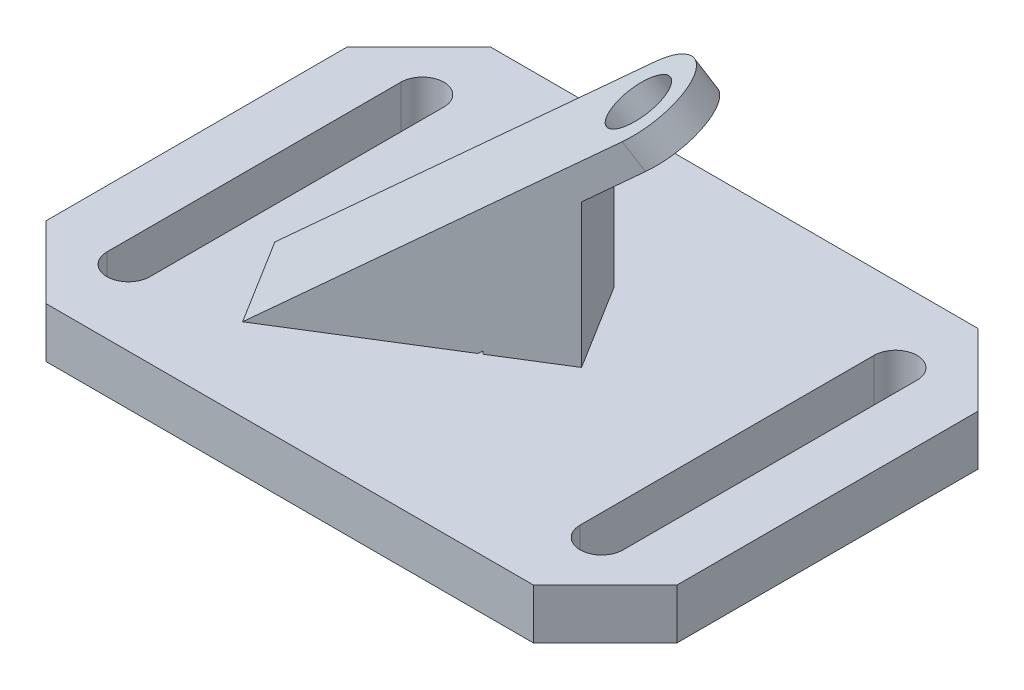
ISO-10303-21;
HEADER;
FILE_DESCRIPTION(('STEP AP214'),'2;1');
FILE_NAME('part.step','',(''),(''),'','','');
FILE_SCHEMA(('AUTOMOTIVE_DESIGN { 1 0 10303 214 1 1 1 1 }'));
ENDSEC;
DATA;
#1=APPLICATION_CONTEXT('core data for automotive mechanical design processes');
#2=APPLICATION_PROTOCOL_DEFINITION('international standard','automotive_design',2000,#1);
#3=PRODUCT_CONTEXT('',#1,'mechanical');
#4=PRODUCT('Part','Part','',(#3));
#5=PRODUCT_RELATED_PRODUCT_CATEGORY('part','',(#4));
#6=PRODUCT_DEFINITION_FORMATION('','',#4);
#7=PRODUCT_DEFINITION_CONTEXT('part definition',#1,'design');
#8=PRODUCT_DEFINITION('design','',#6,#7);
#9=PRODUCT_DEFINITION_SHAPE('','',#8);
#10=(LENGTH_UNIT() NAMED_UNIT(*) SI_UNIT(.MILLI.,.METRE.));
#11=(NAMED_UNIT(*) PLANE_ANGLE_UNIT() SI_UNIT($,.RADIAN.));
#12=(NAMED_UNIT(*) SI_UNIT($,.STERADIAN.) SOLID_ANGLE_UNIT());
#13=UNCERTAINTY_MEASURE_WITH_UNIT(LENGTH_MEASURE(1.E-05),#10,'distance_accuracy_value','');
#14=(GEOMETRIC_REPRESENTATION_CONTEXT(3) GLOBAL_UNCERTAINTY_ASSIGNED_CONTEXT((#13)) GLOBAL_UNIT_ASSIGNED_CONTEXT((#10,
#11,#12)) REPRESENTATION_CONTEXT('',''));
#15=CARTESIAN_POINT('',(0.,0.,0.));
#16=DIRECTION('',(0.,0.,1.));
#17=DIRECTION('',(1.,0.,0.));
#18=AXIS2_PLACEMENT_3D('',#15,#16,#17);
#19=CARTESIAN_POINT('',(0.,7.,0.));
#20=DIRECTION('',(0.,1.,0.));
#21=DIRECTION('',(0.,0.,1.));
#22=AXIS2_PLACEMENT_3D('',#19,#20,#21);
#23=PLANE('',#22);
#24=DIRECTION('',(-1.,0.,0.));
#25=VECTOR('',#24,1.);
#26=CARTESIAN_POINT('',(-34.,7.,-31.));
#27=LINE('',#26,#25);
#28=CARTESIAN_POINT('',(34.,7.,-31.));
#29=VERTEX_POINT('',#28);
#30=CARTESIAN_POINT('',(-34.,7.,-31.));
#31=VERTEX_POINT('',#30);
#32=EDGE_CURVE('E350',#29,#31,#27,.T.);
#33=ORIENTED_EDGE('',*,*,#32,.T.);
#34=DIRECTION('',(-0.707106781186548,0.,0.707106781186547));
#35=VECTOR('',#34,1.);
#36=CARTESIAN_POINT('',(-44.,7.,-21.));
#37=LINE('',#36,#35);
#38=CARTESIAN_POINT('',(-44.,7.,-21.));
#39=VERTEX_POINT('',#38);
#40=EDGE_CURVE('E353',#31,#39,#37,.T.);
#41=ORIENTED_EDGE('',*,*,#40,.T.);
#42=DIRECTION('',(0.,0.,1.));
#43=VECTOR('',#42,1.);
#44=CARTESIAN_POINT('',(-44.,7.,21.));
#45=LINE('',#44,#43);
#46=CARTESIAN_POINT('',(-44.,7.,21.));
#47=VERTEX_POINT('',#46);
#48=EDGE_CURVE('E356',#39,#47,#45,.T.);
#49=ORIENTED_EDGE('',*,*,#48,.T.);
#50=DIRECTION('',(0.707106781186548,0.,0.707106781186547));
#51=VECTOR('',#50,1.);
#52=CARTESIAN_POINT('',(-44.,7.,21.));
#53=LINE('',#52,#51);
#54=CARTESIAN_POINT('',(-34.,7.,31.));
#55=VERTEX_POINT('',#54);
#56=EDGE_CURVE('E358',#47,#55,#53,.T.);
#57=ORIENTED_EDGE('',*,*,#56,.T.);
#58=DIRECTION('',(1.,0.,0.));
#59=VECTOR('',#58,1.);
#60=CARTESIAN_POINT('',(-34.,7.,31.));
#61=LINE('',#60,#59);
#62=CARTESIAN_POINT('',(34.,7.,31.));
#63=VERTEX_POINT('',#62);
#64=EDGE_CURVE('E360',#55,#63,#61,.T.);
#65=ORIENTED_EDGE('',*,*,#64,.T.);
#66=DIRECTION('',(0.707106781186548,0.,-0.707106781186547));
#67=VECTOR('',#66,1.);
#68=CARTESIAN_POINT('',(34.,7.,31.));
#69=LINE('',#68,#67);
#70=CARTESIAN_POINT('',(44.,7.,21.));
#71=VERTEX_POINT('',#70);
#72=EDGE_CURVE('E362',#63,#71,#69,.T.);
#73=ORIENTED_EDGE('',*,*,#72,.T.);
#74=DIRECTION('',(0.,0.,-1.));
#75=VECTOR('',#74,1.);
#76=CARTESIAN_POINT('',(44.,7.,21.));
#77=LINE('',#76,#75);
#78=CARTESIAN_POINT('',(44.,7.,-21.));
#79=VERTEX_POINT('',#78);
#80=EDGE_CURVE('E364',#71,#79,#77,.T.);
#81=ORIENTED_EDGE('',*,*,#80,.T.);
#82=DIRECTION('',(-0.707106781186548,0.,-0.707106781186547));
#83=VECTOR('',#82,1.);
#84=CARTESIAN_POINT('',(34.,7.,-31.));
#85=LINE('',#84,#83);
#86=EDGE_CURVE('E366',#79,#29,#85,.T.);
#87=ORIENTED_EDGE('',*,*,#86,.T.);
#88=EDGE_LOOP('',(#33,#41,#49,#57,#65,#73,#81,#87));
#89=FACE_BOUND('',#88,.T.);
#90=DIRECTION('',(0.,0.,1.));
#91=VECTOR('',#90,1.);
#92=CARTESIAN_POINT('',(-36.,7.,-20.5));
#93=LINE('',#92,#91);
#94=CARTESIAN_POINT('',(-36.,7.,-20.5));
#95=VERTEX_POINT('',#94);
#96=CARTESIAN_POINT('',(-36.,7.,20.5));
#97=VERTEX_POINT('',#96);
#98=EDGE_CURVE('E321',#95,#97,#93,.T.);
#99=ORIENTED_EDGE('',*,*,#98,.F.);
#100=CARTESIAN_POINT('',(-33.,7.,-20.5));
#101=DIRECTION('',(0.,1.,0.));
#102=DIRECTION('',(0.,0.,1.));
#103=AXIS2_PLACEMENT_3D('',#100,#101,#102);
#104=CIRCLE('',#103,3.);
#105=CARTESIAN_POINT('',(-30.,7.,-20.5));
#106=VERTEX_POINT('',#105);
#107=EDGE_CURVE('E319',#106,#95,#104,.T.);
#108=ORIENTED_EDGE('',*,*,#107,.F.);
#109=DIRECTION('',(0.,0.,-1.));
#110=VECTOR('',#109,1.);
#111=CARTESIAN_POINT('',(-30.,7.,-20.5));
#112=LINE('',#111,#110);
#113=CARTESIAN_POINT('',(-30.,7.,20.5));
#114=VERTEX_POINT('',#113);
#115=EDGE_CURVE('E327',#114,#106,#112,.T.);
#116=ORIENTED_EDGE('',*,*,#115,.F.);
#117=CARTESIAN_POINT('',(-33.,7.,20.5));
#118=DIRECTION('',(0.,1.,0.));
#119=DIRECTION('',(0.,0.,1.));
#120=AXIS2_PLACEMENT_3D('',#117,#118,#119);
#121=CIRCLE('',#120,3.00000000000001);
#122=EDGE_CURVE('E324',#97,#114,#121,.T.);
#123=ORIENTED_EDGE('',*,*,#122,.F.);
#124=EDGE_LOOP('',(#99,#108,#116,#123));
#125=FACE_BOUND('',#124,.T.);
#126=DIRECTION('',(0.,0.,1.));
#127=VECTOR('',#126,1.);
#128=CARTESIAN_POINT('',(30.,7.,-20.5));
#129=LINE('',#128,#127);
#130=CARTESIAN_POINT('',(30.,7.,-20.5));
#131=VERTEX_POINT('',#130);
#132=CARTESIAN_POINT('',(30.,7.,20.5));
#133=VERTEX_POINT('',#132);
#134=EDGE_CURVE('E290',#131,#133,#129,.T.);
#135=ORIENTED_EDGE('',*,*,#134,.F.);
#136=CARTESIAN_POINT('',(33.,7.,-20.5));
#137=DIRECTION('',(0.,1.,0.));
#138=DIRECTION('',(0.,0.,1.));
#139=AXIS2_PLACEMENT_3D('',#136,#137,#138);
#140=CIRCLE('',#139,3.);
#141=CARTESIAN_POINT('',(36.,7.,-20.5));
#142=VERTEX_POINT('',#141);
#143=EDGE_CURVE('E288',#142,#131,#140,.T.);
#144=ORIENTED_EDGE('',*,*,#143,.F.);
#145=DIRECTION('',(0.,0.,-1.));
#146=VECTOR('',#145,1.);
#147=CARTESIAN_POINT('',(36.,7.,-20.5));
#148=LINE('',#147,#146);
#149=CARTESIAN_POINT('',(36.,7.,20.5));
#150=VERTEX_POINT('',#149);
#151=EDGE_CURVE('E296',#150,#142,#148,.T.);
#152=ORIENTED_EDGE('',*,*,#151,.F.);
#153=CARTESIAN_POINT('',(33.,7.,20.5));
#154=DIRECTION('',(0.,1.,0.));
#155=DIRECTION('',(0.,0.,1.));
#156=AXIS2_PLACEMENT_3D('',#153,#154,#155);
#157=CIRCLE('',#156,3.);
#158=EDGE_CURVE('E293',#133,#150,#157,.T.);
#159=ORIENTED_EDGE('',*,*,#158,.F.);
#160=EDGE_LOOP('',(#135,#144,#152,#159));
#161=FACE_BOUND('',#160,.T.);
#162=DIRECTION('',(-0.527683201400473,0.,-0.849441251034907));
#163=VECTOR('',#162,1.);
#164=CARTESIAN_POINT('',(11.0657190390386,7.,1.36655236635577));
#165=LINE('',#164,#163);
#166=CARTESIAN_POINT('',(11.0657190390386,7.,1.36655236635577));
#167=VERTEX_POINT('',#166);
#168=CARTESIAN_POINT('',(3.67815421943196,7.,-10.5256251481329));
#169=VERTEX_POINT('',#168);
#170=EDGE_CURVE('E56',#167,#169,#165,.T.);
#171=ORIENTED_EDGE('',*,*,#170,.F.);
#172=DIRECTION('',(-0.849441251034907,0.,0.527683201400473));
#173=VECTOR('',#172,1.);
#174=CARTESIAN_POINT('',(11.0657190390386,7.,1.36655236635577));
#175=LINE('',#174,#173);
#176=CARTESIAN_POINT('',(2.57130652868951,7.,6.6433843803605));
#177=VERTEX_POINT('',#176);
#178=EDGE_CURVE('E51',#167,#177,#175,.T.);
#179=ORIENTED_EDGE('',*,*,#178,.T.);
#180=DIRECTION('',(-0.527683201400473,0.,-0.849441251034907));
#181=VECTOR('',#180,1.);
#182=CARTESIAN_POINT('',(2.57130652868951,7.,6.6433843803605));
#183=LINE('',#182,#181);
#184=CARTESIAN_POINT('',(-4.81625829091711,7.,-5.2487931341282));
#185=VERTEX_POINT('',#184);
#186=EDGE_CURVE('E280',#177,#185,#183,.T.);
#187=ORIENTED_EDGE('',*,*,#186,.T.);
#188=DIRECTION('',(-0.849441251034907,0.,0.527683201400473));
#189=VECTOR('',#188,1.);
#190=CARTESIAN_POINT('',(3.67815421943197,7.,-10.5256251481329));
#191=LINE('',#190,#189);
#192=EDGE_CURVE('E242',#169,#185,#191,.T.);
#193=ORIENTED_EDGE('',*,*,#192,.F.);
#194=EDGE_LOOP('',(#171,#179,#187,#193));
#195=FACE_BOUND('',#194,.T.);
#196=DIRECTION('',(0.527683201400473,0.,0.849441251034907));
#197=VECTOR('',#196,1.);
#198=CARTESIAN_POINT('',(-21.7917980740251,7.,13.5373291065914));
#199=LINE('',#198,#197);
#200=CARTESIAN_POINT('',(-25.4855804838284,7.,7.59124034934704));
#201=VERTEX_POINT('',#200);
#202=CARTESIAN_POINT('',(-18.0980156642218,7.,19.4834178638357));
#203=VERTEX_POINT('',#202);
#204=EDGE_CURVE('E11',#201,#203,#199,.T.);
#205=ORIENTED_EDGE('',*,*,#204,.F.);
#206=DIRECTION('',(-0.849441251034907,0.,0.527683201400473));
#207=VECTOR('',#206,1.);
#208=CARTESIAN_POINT('',(-3.69378240980331,7.,-5.94608875724435));
#209=LINE('',#208,#207);
#210=CARTESIAN_POINT('',(-5.25339965229698,7.,-4.97723562175586));
#211=VERTEX_POINT('',#210);
#212=EDGE_CURVE('E220',#211,#201,#209,.T.);
#213=ORIENTED_EDGE('',*,*,#212,.F.);
#214=DIRECTION('',(0.527683201400473,0.,0.849441251034907));
#215=VECTOR('',#214,1.);
#216=CARTESIAN_POINT('',(-1.55961724249367,7.,0.96885313548849));
#217=LINE('',#216,#215);
#218=CARTESIAN_POINT('',(2.13416516730965,7.,6.91494189273284));
#219=VERTEX_POINT('',#218);
#220=EDGE_CURVE('E285',#211,#219,#217,.T.);
#221=ORIENTED_EDGE('',*,*,#220,.T.);
#222=DIRECTION('',(-0.849441251034907,0.,0.527683201400473));
#223=VECTOR('',#222,1.);
#224=CARTESIAN_POINT('',(3.69378240980331,7.,5.94608875724435));
#225=LINE('',#224,#223);
#226=EDGE_CURVE('E283',#219,#203,#225,.T.);
#227=ORIENTED_EDGE('',*,*,#226,.T.);
#228=EDGE_LOOP('',(#205,#213,#221,#227));
#229=FACE_BOUND('',#228,.T.);
#230=ADVANCED_FACE('F36',(#89,#125,#161,#195,#229),#23,.T.);
#231=CARTESIAN_POINT('',(0.,0.,0.));
#232=DIRECTION('',(0.,1.,0.));
#233=DIRECTION('',(0.,0.,1.));
#234=AXIS2_PLACEMENT_3D('',#231,#232,#233);
#235=PLANE('',#234);
#236=CARTESIAN_POINT('',(33.,0.,-20.5));
#237=DIRECTION('',(0.,1.,0.));
#238=DIRECTION('',(0.,0.,1.));
#239=AXIS2_PLACEMENT_3D('',#236,#237,#238);
#240=CIRCLE('',#239,3.);
#241=CARTESIAN_POINT('',(36.,0.,-20.5));
#242=VERTEX_POINT('',#241);
#243=CARTESIAN_POINT('',(30.,0.,-20.5));
#244=VERTEX_POINT('',#243);
#245=EDGE_CURVE('E287',#242,#244,#240,.T.);
#246=ORIENTED_EDGE('',*,*,#245,.T.);
#247=DIRECTION('',(0.,0.,1.));
#248=VECTOR('',#247,1.);
#249=CARTESIAN_POINT('',(30.,0.,-20.5));
#250=LINE('',#249,#248);
#251=CARTESIAN_POINT('',(30.,0.,20.5));
#252=VERTEX_POINT('',#251);
#253=EDGE_CURVE('E301',#244,#252,#250,.T.);
#254=ORIENTED_EDGE('',*,*,#253,.T.);
#255=CARTESIAN_POINT('',(33.,0.,20.5));
#256=DIRECTION('',(0.,1.,0.));
#257=DIRECTION('',(0.,0.,1.));
#258=AXIS2_PLACEMENT_3D('',#255,#256,#257);
#259=CIRCLE('',#258,3.);
#260=CARTESIAN_POINT('',(36.,0.,20.5));
#261=VERTEX_POINT('',#260);
#262=EDGE_CURVE('E304',#252,#261,#259,.T.);
#263=ORIENTED_EDGE('',*,*,#262,.T.);
#264=DIRECTION('',(0.,0.,-1.));
#265=VECTOR('',#264,1.);
#266=CARTESIAN_POINT('',(36.,0.,-20.5));
#267=LINE('',#266,#265);
#268=EDGE_CURVE('E291',#261,#242,#267,.T.);
#269=ORIENTED_EDGE('',*,*,#268,.T.);
#270=EDGE_LOOP('',(#246,#254,#263,#269));
#271=FACE_BOUND('',#270,.T.);
#272=DIRECTION('',(-1.,0.,0.));
#273=VECTOR('',#272,1.);
#274=CARTESIAN_POINT('',(-34.,0.,-31.));
#275=LINE('',#274,#273);
#276=CARTESIAN_POINT('',(34.,0.,-31.));
#277=VERTEX_POINT('',#276);
#278=CARTESIAN_POINT('',(-34.,0.,-31.));
#279=VERTEX_POINT('',#278);
#280=EDGE_CURVE('E349',#277,#279,#275,.T.);
#281=ORIENTED_EDGE('',*,*,#280,.F.);
#282=DIRECTION('',(-0.707106781186548,0.,-0.707106781186547));
#283=VECTOR('',#282,1.);
#284=CARTESIAN_POINT('',(34.,0.,-31.));
#285=LINE('',#284,#283);
#286=CARTESIAN_POINT('',(44.,0.,-21.));
#287=VERTEX_POINT('',#286);
#288=EDGE_CURVE('E354',#287,#277,#285,.T.);
#289=ORIENTED_EDGE('',*,*,#288,.F.);
#290=DIRECTION('',(0.,0.,-1.));
#291=VECTOR('',#290,1.);
#292=CARTESIAN_POINT('',(44.,0.,21.));
#293=LINE('',#292,#291);
#294=CARTESIAN_POINT('',(44.,0.,21.));
#295=VERTEX_POINT('',#294);
#296=EDGE_CURVE('E381',#295,#287,#293,.T.);
#297=ORIENTED_EDGE('',*,*,#296,.F.);
#298=DIRECTION('',(0.707106781186548,0.,-0.707106781186547));
#299=VECTOR('',#298,1.);
#300=CARTESIAN_POINT('',(34.,0.,31.));
#301=LINE('',#300,#299);
#302=CARTESIAN_POINT('',(34.,0.,31.));
#303=VERTEX_POINT('',#302);
#304=EDGE_CURVE('E379',#303,#295,#301,.T.);
#305=ORIENTED_EDGE('',*,*,#304,.F.);
#306=DIRECTION('',(1.,0.,0.));
#307=VECTOR('',#306,1.);
#308=CARTESIAN_POINT('',(-34.,0.,31.));
#309=LINE('',#308,#307);
#310=CARTESIAN_POINT('',(-34.,0.,31.));
#311=VERTEX_POINT('',#310);
#312=EDGE_CURVE('E377',#311,#303,#309,.T.);
#313=ORIENTED_EDGE('',*,*,#312,.F.);
#314=DIRECTION('',(0.707106781186548,0.,0.707106781186547));
#315=VECTOR('',#314,1.);
#316=CARTESIAN_POINT('',(-44.,0.,21.));
#317=LINE('',#316,#315);
#318=CARTESIAN_POINT('',(-44.,0.,21.));
#319=VERTEX_POINT('',#318);
#320=EDGE_CURVE('E375',#319,#311,#317,.T.);
#321=ORIENTED_EDGE('',*,*,#320,.F.);
#322=DIRECTION('',(0.,0.,1.));
#323=VECTOR('',#322,1.);
#324=CARTESIAN_POINT('',(-44.,0.,21.));
#325=LINE('',#324,#323);
#326=CARTESIAN_POINT('',(-44.,0.,-21.));
#327=VERTEX_POINT('',#326);
#328=EDGE_CURVE('E373',#327,#319,#325,.T.);
#329=ORIENTED_EDGE('',*,*,#328,.F.);
#330=DIRECTION('',(-0.707106781186548,0.,0.707106781186547));
#331=VECTOR('',#330,1.);
#332=CARTESIAN_POINT('',(-44.,0.,-21.));
#333=LINE('',#332,#331);
#334=EDGE_CURVE('E371',#279,#327,#333,.T.);
#335=ORIENTED_EDGE('',*,*,#334,.F.);
#336=EDGE_LOOP('',(#281,#289,#297,#305,#313,#321,#329,#335));
#337=FACE_BOUND('',#336,.T.);
#338=CARTESIAN_POINT('',(-33.,0.,-20.5));
#339=DIRECTION('',(0.,1.,0.));
#340=DIRECTION('',(0.,0.,1.));
#341=AXIS2_PLACEMENT_3D('',#338,#339,#340);
#342=CIRCLE('',#341,3.);
#343=CARTESIAN_POINT('',(-30.,0.,-20.5));
#344=VERTEX_POINT('',#343);
#345=CARTESIAN_POINT('',(-36.,0.,-20.5));
#346=VERTEX_POINT('',#345);
#347=EDGE_CURVE('E318',#344,#346,#342,.T.);
#348=ORIENTED_EDGE('',*,*,#347,.T.);
#349=DIRECTION('',(0.,0.,1.));
#350=VECTOR('',#349,1.);
#351=CARTESIAN_POINT('',(-36.,0.,-20.5));
#352=LINE('',#351,#350);
#353=CARTESIAN_POINT('',(-36.,0.,20.5));
#354=VERTEX_POINT('',#353);
#355=EDGE_CURVE('E332',#346,#354,#352,.T.);
#356=ORIENTED_EDGE('',*,*,#355,.T.);
#357=CARTESIAN_POINT('',(-33.,0.,20.5));
#358=DIRECTION('',(0.,1.,0.));
#359=DIRECTION('',(0.,0.,1.));
#360=AXIS2_PLACEMENT_3D('',#357,#358,#359);
#361=CIRCLE('',#360,3.00000000000001);
#362=CARTESIAN_POINT('',(-30.,0.,20.5));
#363=VERTEX_POINT('',#362);
#364=EDGE_CURVE('E335',#354,#363,#361,.T.);
#365=ORIENTED_EDGE('',*,*,#364,.T.);
#366=DIRECTION('',(0.,0.,-1.));
#367=VECTOR('',#366,1.);
#368=CARTESIAN_POINT('',(-30.,0.,-20.5));
#369=LINE('',#368,#367);
#370=EDGE_CURVE('E322',#363,#344,#369,.T.);
#371=ORIENTED_EDGE('',*,*,#370,.T.);
#372=EDGE_LOOP('',(#348,#356,#365,#371));
#373=FACE_BOUND('',#372,.T.);
#374=DIRECTION('',(-0.849441251034907,0.,0.527683201400473));
#375=VECTOR('',#374,1.);
#376=CARTESIAN_POINT('',(3.69378240980331,0.,5.94608875724435));
#377=LINE('',#376,#375);
#378=CARTESIAN_POINT('',(-6.04992389567836,0.,11.9989972197405));
#379=VERTEX_POINT('',#378);
#380=CARTESIAN_POINT('',(-7.99730621206597,0.,13.2087347193147));
#381=VERTEX_POINT('',#380);
#382=EDGE_CURVE('E44',#379,#381,#377,.T.);
#383=ORIENTED_EDGE('',*,*,#382,.F.);
#384=DIRECTION('',(0.527683201400473,0.,0.849441251034907));
#385=VECTOR('',#384,1.);
#386=CARTESIAN_POINT('',(-9.74370630548166,0.,6.05290846249619));
#387=LINE('',#386,#385);
#388=CARTESIAN_POINT('',(-13.437488715285,0.,0.10681970525184));
#389=VERTEX_POINT('',#388);
#390=EDGE_CURVE('E410',#389,#379,#387,.T.);
#391=ORIENTED_EDGE('',*,*,#390,.F.);
#392=DIRECTION('',(-0.849441251034907,0.,0.527683201400473));
#393=VECTOR('',#392,1.);
#394=CARTESIAN_POINT('',(-3.69378240980331,0.,-5.94608875724435));
#395=LINE('',#394,#393);
#396=CARTESIAN_POINT('',(-15.3848710316726,0.,1.31655720482596));
#397=VERTEX_POINT('',#396);
#398=EDGE_CURVE('E407',#389,#397,#395,.T.);
#399=ORIENTED_EDGE('',*,*,#398,.T.);
#400=DIRECTION('',(0.527683201400473,0.,0.849441251034907));
#401=VECTOR('',#400,1.);
#402=CARTESIAN_POINT('',(-11.6910886218693,0.,7.26264596207031));
#403=LINE('',#402,#401);
#404=EDGE_CURVE('E412',#397,#381,#403,.T.);
#405=ORIENTED_EDGE('',*,*,#404,.T.);
#406=EDGE_LOOP('',(#383,#391,#399,#405));
#407=FACE_BOUND('',#406,.T.);
#408=ADVANCED_FACE('F425',(#271,#337,#373,#407),#235,.F.);
#409=CARTESIAN_POINT('',(-34.,7.,-31.));
#410=DIRECTION('',(0.,0.,1.));
#411=DIRECTION('',(1.,0.,0.));
#412=AXIS2_PLACEMENT_3D('',#409,#410,#411);
#413=PLANE('',#412);
#414=ORIENTED_EDGE('',*,*,#280,.T.);
#415=DIRECTION('',(0.,-1.,0.));
#416=VECTOR('',#415,1.);
#417=CARTESIAN_POINT('',(-34.,7.,-31.));
#418=LINE('',#417,#416);
#419=EDGE_CURVE('E404',#31,#279,#418,.T.);
#420=ORIENTED_EDGE('',*,*,#419,.F.);
#421=ORIENTED_EDGE('',*,*,#32,.F.);
#422=DIRECTION('',(0.,-1.,0.));
#423=VECTOR('',#422,1.);
#424=CARTESIAN_POINT('',(34.,7.,-31.));
#425=LINE('',#424,#423);
#426=EDGE_CURVE('E368',#29,#277,#425,.T.);
#427=ORIENTED_EDGE('',*,*,#426,.T.);
#428=EDGE_LOOP('',(#414,#420,#421,#427));
#429=FACE_BOUND('',#428,.T.);
#430=ADVANCED_FACE('F38',(#429),#413,.F.);
#431=CARTESIAN_POINT('',(-44.,7.,-21.));
#432=DIRECTION('',(0.707106781186547,0.,0.707106781186548));
#433=DIRECTION('',(0.707106781186548,0.,-0.707106781186547));
#434=AXIS2_PLACEMENT_3D('',#431,#432,#433);
#435=PLANE('',#434);
#436=ORIENTED_EDGE('',*,*,#334,.T.);
#437=DIRECTION('',(0.,-1.,0.));
#438=VECTOR('',#437,1.);
#439=CARTESIAN_POINT('',(-44.,7.,-21.));
#440=LINE('',#439,#438);
#441=EDGE_CURVE('E401',#39,#327,#440,.T.);
#442=ORIENTED_EDGE('',*,*,#441,.F.);
#443=ORIENTED_EDGE('',*,*,#40,.F.);
#444=ORIENTED_EDGE('',*,*,#419,.T.);
#445=EDGE_LOOP('',(#436,#442,#443,#444));
#446=FACE_BOUND('',#445,.T.);
#447=ADVANCED_FACE('F480',(#446),#435,.F.);
#448=CARTESIAN_POINT('',(-44.,7.,21.));
#449=DIRECTION('',(1.,0.,0.));
#450=DIRECTION('',(0.,0.,-1.));
#451=AXIS2_PLACEMENT_3D('',#448,#449,#450);
#452=PLANE('',#451);
#453=ORIENTED_EDGE('',*,*,#328,.T.);
#454=DIRECTION('',(0.,-1.,0.));
#455=VECTOR('',#454,1.);
#456=CARTESIAN_POINT('',(-44.,7.,21.));
#457=LINE('',#456,#455);
#458=EDGE_CURVE('E398',#47,#319,#457,.T.);
#459=ORIENTED_EDGE('',*,*,#458,.F.);
#460=ORIENTED_EDGE('',*,*,#48,.F.);
#461=ORIENTED_EDGE('',*,*,#441,.T.);
#462=EDGE_LOOP('',(#453,#459,#460,#461));
#463=FACE_BOUND('',#462,.T.);
#464=ADVANCED_FACE('F477',(#463),#452,.F.);
#465=CARTESIAN_POINT('',(-44.,7.,21.));
#466=DIRECTION('',(0.707106781186547,0.,-0.707106781186548));
#467=DIRECTION('',(-0.707106781186548,0.,-0.707106781186547));
#468=AXIS2_PLACEMENT_3D('',#465,#466,#467);
#469=PLANE('',#468);
#470=ORIENTED_EDGE('',*,*,#320,.T.);
#471=DIRECTION('',(0.,-1.,0.));
#472=VECTOR('',#471,1.);
#473=CARTESIAN_POINT('',(-34.,7.,31.));
#474=LINE('',#473,#472);
#475=EDGE_CURVE('E395',#55,#311,#474,.T.);
#476=ORIENTED_EDGE('',*,*,#475,.F.);
#477=ORIENTED_EDGE('',*,*,#56,.F.);
#478=ORIENTED_EDGE('',*,*,#458,.T.);
#479=EDGE_LOOP('',(#470,#476,#477,#478));
#480=FACE_BOUND('',#479,.T.);
#481=ADVANCED_FACE('F473',(#480),#469,.F.);
#482=CARTESIAN_POINT('',(-34.,7.,31.));
#483=DIRECTION('',(0.,0.,-1.));
#484=DIRECTION('',(-1.,0.,0.));
#485=AXIS2_PLACEMENT_3D('',#482,#483,#484);
#486=PLANE('',#485);
#487=ORIENTED_EDGE('',*,*,#312,.T.);
#488=DIRECTION('',(0.,-1.,0.));
#489=VECTOR('',#488,1.);
#490=CARTESIAN_POINT('',(34.,7.,31.));
#491=LINE('',#490,#489);
#492=EDGE_CURVE('E392',#63,#303,#491,.T.);
#493=ORIENTED_EDGE('',*,*,#492,.F.);
#494=ORIENTED_EDGE('',*,*,#64,.F.);
#495=ORIENTED_EDGE('',*,*,#475,.T.);
#496=EDGE_LOOP('',(#487,#493,#494,#495));
#497=FACE_BOUND('',#496,.T.);
#498=ADVANCED_FACE('F469',(#497),#486,.F.);
#499=CARTESIAN_POINT('',(34.,7.,31.));
#500=DIRECTION('',(-0.707106781186547,0.,-0.707106781186548));
#501=DIRECTION('',(-0.707106781186548,0.,0.707106781186547));
#502=AXIS2_PLACEMENT_3D('',#499,#500,#501);
#503=PLANE('',#502);
#504=ORIENTED_EDGE('',*,*,#304,.T.);
#505=DIRECTION('',(0.,-1.,0.));
#506=VECTOR('',#505,1.);
#507=CARTESIAN_POINT('',(44.,7.,21.));
#508=LINE('',#507,#506);
#509=EDGE_CURVE('E389',#71,#295,#508,.T.);
#510=ORIENTED_EDGE('',*,*,#509,.F.);
#511=ORIENTED_EDGE('',*,*,#72,.F.);
#512=ORIENTED_EDGE('',*,*,#492,.T.);
#513=EDGE_LOOP('',(#504,#510,#511,#512));
#514=FACE_BOUND('',#513,.T.);
#515=ADVANCED_FACE('F465',(#514),#503,.F.);
#516=CARTESIAN_POINT('',(44.,7.,21.));
#517=DIRECTION('',(-1.,0.,0.));
#518=DIRECTION('',(0.,0.,1.));
#519=AXIS2_PLACEMENT_3D('',#516,#517,#518);
#520=PLANE('',#519);
#521=ORIENTED_EDGE('',*,*,#296,.T.);
#522=DIRECTION('',(0.,-1.,0.));
#523=VECTOR('',#522,1.);
#524=CARTESIAN_POINT('',(44.,7.,-21.));
#525=LINE('',#524,#523);
#526=EDGE_CURVE('E386',#79,#287,#525,.T.);
#527=ORIENTED_EDGE('',*,*,#526,.F.);
#528=ORIENTED_EDGE('',*,*,#80,.F.);
#529=ORIENTED_EDGE('',*,*,#509,.T.);
#530=EDGE_LOOP('',(#521,#527,#528,#529));
#531=FACE_BOUND('',#530,.T.);
#532=ADVANCED_FACE('F461',(#531),#520,.F.);
#533=CARTESIAN_POINT('',(34.,7.,-31.));
#534=DIRECTION('',(-0.707106781186547,0.,0.707106781186548));
#535=DIRECTION('',(0.707106781186548,0.,0.707106781186547));
#536=AXIS2_PLACEMENT_3D('',#533,#534,#535);
#537=PLANE('',#536);
#538=ORIENTED_EDGE('',*,*,#288,.T.);
#539=ORIENTED_EDGE('',*,*,#426,.F.);
#540=ORIENTED_EDGE('',*,*,#86,.F.);
#541=ORIENTED_EDGE('',*,*,#526,.T.);
#542=EDGE_LOOP('',(#538,#539,#540,#541));
#543=FACE_BOUND('',#542,.T.);
#544=ADVANCED_FACE('F458',(#543),#537,.F.);
#545=CARTESIAN_POINT('',(-33.,7.,-20.5));
#546=DIRECTION('',(0.,-1.,0.));
#547=DIRECTION('',(0.,0.,-1.));
#548=AXIS2_PLACEMENT_3D('',#545,#546,#547);
#549=CYLINDRICAL_SURFACE('',#548,3.);
#550=ORIENTED_EDGE('',*,*,#347,.F.);
#551=DIRECTION('',(0.,-1.,0.));
#552=VECTOR('',#551,1.);
#553=CARTESIAN_POINT('',(-30.,7.,-20.5));
#554=LINE('',#553,#552);
#555=EDGE_CURVE('E329',#106,#344,#554,.T.);
#556=ORIENTED_EDGE('',*,*,#555,.F.);
#557=ORIENTED_EDGE('',*,*,#107,.T.);
#558=DIRECTION('',(0.,-1.,0.));
#559=VECTOR('',#558,1.);
#560=CARTESIAN_POINT('',(-36.,7.,-20.5));
#561=LINE('',#560,#559);
#562=EDGE_CURVE('E346',#95,#346,#561,.T.);
#563=ORIENTED_EDGE('',*,*,#562,.T.);
#564=EDGE_LOOP('',(#550,#556,#557,#563));
#565=FACE_BOUND('',#564,.T.);
#566=ADVANCED_FACE('F455',(#565),#549,.F.);
#567=CARTESIAN_POINT('',(-36.,7.,-20.5));
#568=DIRECTION('',(1.,0.,0.));
#569=DIRECTION('',(0.,0.,-1.));
#570=AXIS2_PLACEMENT_3D('',#567,#568,#569);
#571=PLANE('',#570);
#572=ORIENTED_EDGE('',*,*,#355,.F.);
#573=ORIENTED_EDGE('',*,*,#562,.F.);
#574=ORIENTED_EDGE('',*,*,#98,.T.);
#575=DIRECTION('',(0.,-1.,0.));
#576=VECTOR('',#575,1.);
#577=CARTESIAN_POINT('',(-36.,7.,20.5));
#578=LINE('',#577,#576);
#579=EDGE_CURVE('E344',#97,#354,#578,.T.);
#580=ORIENTED_EDGE('',*,*,#579,.T.);
#581=EDGE_LOOP('',(#572,#573,#574,#580));
#582=FACE_BOUND('',#581,.T.);
#583=ADVANCED_FACE('F524',(#582),#571,.T.);
#584=CARTESIAN_POINT('',(-33.,7.,20.5));
#585=DIRECTION('',(0.,-1.,0.));
#586=DIRECTION('',(0.,0.,-1.));
#587=AXIS2_PLACEMENT_3D('',#584,#585,#586);
#588=CYLINDRICAL_SURFACE('',#587,3.00000000000001);
#589=ORIENTED_EDGE('',*,*,#364,.F.);
#590=ORIENTED_EDGE('',*,*,#579,.F.);
#591=ORIENTED_EDGE('',*,*,#122,.T.);
#592=DIRECTION('',(0.,-1.,0.));
#593=VECTOR('',#592,1.);
#594=CARTESIAN_POINT('',(-30.,7.,20.5));
#595=LINE('',#594,#593);
#596=EDGE_CURVE('E342',#114,#363,#595,.T.);
#597=ORIENTED_EDGE('',*,*,#596,.T.);
#598=EDGE_LOOP('',(#589,#590,#591,#597));
#599=FACE_BOUND('',#598,.T.);
#600=ADVANCED_FACE('F528',(#599),#588,.F.);
#601=CARTESIAN_POINT('',(-30.,7.,-20.5));
#602=DIRECTION('',(-1.,0.,0.));
#603=DIRECTION('',(0.,0.,1.));
#604=AXIS2_PLACEMENT_3D('',#601,#602,#603);
#605=PLANE('',#604);
#606=ORIENTED_EDGE('',*,*,#370,.F.);
#607=ORIENTED_EDGE('',*,*,#596,.F.);
#608=ORIENTED_EDGE('',*,*,#115,.T.);
#609=ORIENTED_EDGE('',*,*,#555,.T.);
#610=EDGE_LOOP('',(#606,#607,#608,#609));
#611=FACE_BOUND('',#610,.T.);
#612=ADVANCED_FACE('F518',(#611),#605,.T.);
#613=CARTESIAN_POINT('',(33.,7.,-20.5));
#614=DIRECTION('',(0.,-1.,0.));
#615=DIRECTION('',(0.,0.,-1.));
#616=AXIS2_PLACEMENT_3D('',#613,#614,#615);
#617=CYLINDRICAL_SURFACE('',#616,3.);
#618=ORIENTED_EDGE('',*,*,#245,.F.);
#619=DIRECTION('',(0.,-1.,0.));
#620=VECTOR('',#619,1.);
#621=CARTESIAN_POINT('',(36.,7.,-20.5));
#622=LINE('',#621,#620);
#623=EDGE_CURVE('E298',#142,#242,#622,.T.);
#624=ORIENTED_EDGE('',*,*,#623,.F.);
#625=ORIENTED_EDGE('',*,*,#143,.T.);
#626=DIRECTION('',(0.,-1.,0.));
#627=VECTOR('',#626,1.);
#628=CARTESIAN_POINT('',(30.,7.,-20.5));
#629=LINE('',#628,#627);
#630=EDGE_CURVE('E315',#131,#244,#629,.T.);
#631=ORIENTED_EDGE('',*,*,#630,.T.);
#632=EDGE_LOOP('',(#618,#624,#625,#631));
#633=FACE_BOUND('',#632,.T.);
#634=ADVANCED_FACE('F535',(#633),#617,.F.);
#635=CARTESIAN_POINT('',(30.,7.,-20.5));
#636=DIRECTION('',(1.,0.,0.));
#637=DIRECTION('',(0.,0.,-1.));
#638=AXIS2_PLACEMENT_3D('',#635,#636,#637);
#639=PLANE('',#638);
#640=ORIENTED_EDGE('',*,*,#253,.F.);
#641=ORIENTED_EDGE('',*,*,#630,.F.);
#642=ORIENTED_EDGE('',*,*,#134,.T.);
#643=DIRECTION('',(0.,-1.,0.));
#644=VECTOR('',#643,1.);
#645=CARTESIAN_POINT('',(30.,7.,20.5));
#646=LINE('',#645,#644);
#647=EDGE_CURVE('E313',#133,#252,#646,.T.);
#648=ORIENTED_EDGE('',*,*,#647,.T.);
#649=EDGE_LOOP('',(#640,#641,#642,#648));
#650=FACE_BOUND('',#649,.T.);
#651=ADVANCED_FACE('F540',(#650),#639,.T.);
#652=CARTESIAN_POINT('',(33.,7.,20.5));
#653=DIRECTION('',(0.,-1.,0.));
#654=DIRECTION('',(0.,0.,-1.));
#655=AXIS2_PLACEMENT_3D('',#652,#653,#654);
#656=CYLINDRICAL_SURFACE('',#655,3.);
#657=ORIENTED_EDGE('',*,*,#262,.F.);
#658=ORIENTED_EDGE('',*,*,#647,.F.);
#659=ORIENTED_EDGE('',*,*,#158,.T.);
#660=DIRECTION('',(0.,-1.,0.));
#661=VECTOR('',#660,1.);
#662=CARTESIAN_POINT('',(36.,7.,20.5));
#663=LINE('',#662,#661);
#664=EDGE_CURVE('E311',#150,#261,#663,.T.);
#665=ORIENTED_EDGE('',*,*,#664,.T.);
#666=EDGE_LOOP('',(#657,#658,#659,#665));
#667=FACE_BOUND('',#666,.T.);
#668=ADVANCED_FACE('F544',(#667),#656,.F.);
#669=CARTESIAN_POINT('',(36.,7.,-20.5));
#670=DIRECTION('',(-1.,0.,0.));
#671=DIRECTION('',(0.,0.,1.));
#672=AXIS2_PLACEMENT_3D('',#669,#670,#671);
#673=PLANE('',#672);
#674=ORIENTED_EDGE('',*,*,#268,.F.);
#675=ORIENTED_EDGE('',*,*,#664,.F.);
#676=ORIENTED_EDGE('',*,*,#151,.T.);
#677=ORIENTED_EDGE('',*,*,#623,.T.);
#678=EDGE_LOOP('',(#674,#675,#676,#677));
#679=FACE_BOUND('',#678,.T.);
#680=ADVANCED_FACE('F548',(#679),#673,.T.);
#681=CARTESIAN_POINT('',(3.69378240980331,0.,5.94608875724435));
#682=DIRECTION('',(-0.527683201400473,0.,-0.849441251034907));
#683=DIRECTION('',(-0.849441251034907,0.,0.527683201400473));
#684=AXIS2_PLACEMENT_3D('',#681,#682,#683);
#685=PLANE('',#684);
#686=DIRECTION('',(0.687212407810355,0.587785252292475,-0.42690467757916));
#687=VECTOR('',#686,1.);
#688=CARTESIAN_POINT('',(-7.32450216902667,-1.09016994374946,12.7907806925781));
#689=LINE('',#688,#687);
#690=CARTESIAN_POINT('',(-7.32450216902667,-1.09016994374946,12.7907806925781));
#691=VERTEX_POINT('',#690);
#692=EDGE_CURVE('E258',#691,#379,#689,.T.);
#693=ORIENTED_EDGE('',*,*,#692,.T.);
#694=ORIENTED_EDGE('',*,*,#382,.T.);
#695=DIRECTION('',(-0.499289040047188,0.809016994374946,0.310164403665678));
#696=VECTOR('',#695,1.);
#697=CARTESIAN_POINT('',(-7.32450216902667,-1.09016994374946,12.7907806925781));
#698=LINE('',#697,#696);
#699=EDGE_CURVE('E254',#691,#381,#698,.T.);
#700=ORIENTED_EDGE('',*,*,#699,.F.);
#701=EDGE_LOOP('',(#693,#694,#700));
#702=FACE_BOUND('',#701,.T.);
#703=ADVANCED_FACE('F417',(#702),#685,.F.);
#704=CARTESIAN_POINT('',(-3.69378240980331,0.,-5.94608875724435));
#705=DIRECTION('',(-0.527683201400473,0.,-0.849441251034907));
#706=DIRECTION('',(-0.849441251034907,0.,0.527683201400473));
#707=AXIS2_PLACEMENT_3D('',#704,#705,#706);
#708=PLANE('',#707);
#709=ORIENTED_EDGE('',*,*,#398,.F.);
#710=DIRECTION('',(0.687212407810355,0.587785252292475,-0.42690467757916));
#711=VECTOR('',#710,1.);
#712=CARTESIAN_POINT('',(-14.7120669886333,-1.09016994374946,0.898603178089428));
#713=LINE('',#712,#711);
#714=CARTESIAN_POINT('',(-14.7120669886333,-1.09016994374946,0.898603178089428));
#715=VERTEX_POINT('',#714);
#716=EDGE_CURVE('E249',#715,#389,#713,.T.);
#717=ORIENTED_EDGE('',*,*,#716,.F.);
#718=DIRECTION('',(-0.499289040047188,0.809016994374946,0.310164403665678));
#719=VECTOR('',#718,1.);
#720=CARTESIAN_POINT('',(-14.7120669886333,-1.09016994374946,0.898603178089428));
#721=LINE('',#720,#719);
#722=EDGE_CURVE('E267',#715,#397,#721,.T.);
#723=ORIENTED_EDGE('',*,*,#722,.T.);
#724=EDGE_LOOP('',(#709,#717,#723));
#725=FACE_BOUND('',#724,.T.);
#726=ADVANCED_FACE('F428',(#725),#708,.T.);
#727=CARTESIAN_POINT('',(-7.32450216902667,-1.09016994374946,12.7907806925781));
#728=DIRECTION('',(-0.499289040047188,0.809016994374946,0.310164403665678));
#729=DIRECTION('',(-0.850985081019815,-0.525189862698909,0.));
#730=AXIS2_PLACEMENT_3D('',#727,#728,#729);
#731=PLANE('',#730);
#732=ORIENTED_EDGE('',*,*,#716,.T.);
#733=ORIENTED_EDGE('',*,*,#390,.T.);
#734=ORIENTED_EDGE('',*,*,#692,.F.);
#735=DIRECTION('',(-0.527683201400473,0.,-0.849441251034907));
#736=VECTOR('',#735,1.);
#737=CARTESIAN_POINT('',(-7.32450216902667,-1.09016994374946,12.7907806925781));
#738=LINE('',#737,#736);
#739=EDGE_CURVE('E274',#691,#715,#738,.T.);
#740=ORIENTED_EDGE('',*,*,#739,.T.);
#741=EDGE_LOOP('',(#732,#733,#734,#740));
#742=FACE_BOUND('',#741,.T.);
#743=ADVANCED_FACE('F430',(#742),#731,.F.);
#744=CARTESIAN_POINT('',(-7.32450216902667,-1.09016994374946,12.7907806925781));
#745=DIRECTION('',(-0.687212407810355,-0.587785252292475,0.42690467757916));
#746=DIRECTION('',(0.649991642509849,-0.759941356071209,0.));
#747=AXIS2_PLACEMENT_3D('',#744,#745,#746);
#748=PLANE('',#747);
#749=ORIENTED_EDGE('',*,*,#404,.F.);
#750=ORIENTED_EDGE('',*,*,#722,.F.);
#751=ORIENTED_EDGE('',*,*,#739,.F.);
#752=ORIENTED_EDGE('',*,*,#699,.T.);
#753=EDGE_LOOP('',(#749,#750,#751,#752));
#754=FACE_BOUND('',#753,.T.);
#755=ADVANCED_FACE('F423',(#754),#748,.T.);
#756=CARTESIAN_POINT('',(2.57130652868951,27.,6.6433843803605));
#757=DIRECTION('',(0.849441251034907,0.,-0.527683201400473));
#758=DIRECTION('',(-0.527683201400473,0.,-0.849441251034907));
#759=AXIS2_PLACEMENT_3D('',#756,#757,#758);
#760=PLANE('',#759);
#761=DIRECTION('',(0.,-1.,0.));
#762=VECTOR('',#761,1.);
#763=CARTESIAN_POINT('',(-4.81625829091711,27.,-5.2487931341282));
#764=LINE('',#763,#762);
#765=CARTESIAN_POINT('',(-4.81625829091711,7.37389494494844,-5.2487931341282));
#766=VERTEX_POINT('',#765);
#767=EDGE_CURVE('E238',#766,#185,#764,.T.);
#768=ORIENTED_EDGE('',*,*,#767,.T.);
#769=ORIENTED_EDGE('',*,*,#186,.F.);
#770=DIRECTION('',(0.,-1.,0.));
#771=VECTOR('',#770,1.);
#772=CARTESIAN_POINT('',(2.57130652868951,27.,6.6433843803605));
#773=LINE('',#772,#771);
#774=CARTESIAN_POINT('',(2.57130652868951,7.37389494494844,6.6433843803605));
#775=VERTEX_POINT('',#774);
#776=EDGE_CURVE('E247',#775,#177,#773,.T.);
#777=ORIENTED_EDGE('',*,*,#776,.F.);
#778=DIRECTION('',(-0.527683201400473,0.,-0.849441251034907));
#779=VECTOR('',#778,1.);
#780=CARTESIAN_POINT('',(2.57130652868951,7.37389494494844,6.6433843803605));
#781=LINE('',#780,#779);
#782=EDGE_CURVE('E260',#775,#766,#781,.T.);
#783=ORIENTED_EDGE('',*,*,#782,.T.);
#784=EDGE_LOOP('',(#768,#769,#777,#783));
#785=FACE_BOUND('',#784,.T.);
#786=ADVANCED_FACE('F438',(#785),#760,.F.);
#787=CARTESIAN_POINT('',(11.0657190390386,27.,1.36655236635577));
#788=DIRECTION('',(0.849441251034907,0.,-0.527683201400473));
#789=DIRECTION('',(-0.527683201400473,0.,-0.849441251034907));
#790=AXIS2_PLACEMENT_3D('',#787,#788,#789);
#791=PLANE('',#790);
#792=DIRECTION('',(0.,-1.,0.));
#793=VECTOR('',#792,1.);
#794=CARTESIAN_POINT('',(3.67815421943196,27.,-10.5256251481329));
#795=LINE('',#794,#793);
#796=CARTESIAN_POINT('',(3.67815421943196,27.,-10.5256251481329));
#797=VERTEX_POINT('',#796);
#798=EDGE_CURVE('E264',#797,#169,#795,.T.);
#799=ORIENTED_EDGE('',*,*,#798,.F.);
#800=DIRECTION('',(-0.527683201400473,0.,-0.849441251034907));
#801=VECTOR('',#800,1.);
#802=CARTESIAN_POINT('',(11.0657190390386,27.,1.36655236635577));
#803=LINE('',#802,#801);
#804=CARTESIAN_POINT('',(11.0657190390386,27.,1.36655236635577));
#805=VERTEX_POINT('',#804);
#806=EDGE_CURVE('E276',#805,#797,#803,.T.);
#807=ORIENTED_EDGE('',*,*,#806,.F.);
#808=DIRECTION('',(0.,-1.,0.));
#809=VECTOR('',#808,1.);
#810=CARTESIAN_POINT('',(11.0657190390386,27.,1.36655236635577));
#811=LINE('',#810,#809);
#812=EDGE_CURVE('E251',#805,#167,#811,.T.);
#813=ORIENTED_EDGE('',*,*,#812,.T.);
#814=ORIENTED_EDGE('',*,*,#170,.T.);
#815=EDGE_LOOP('',(#799,#807,#813,#814));
#816=FACE_BOUND('',#815,.T.);
#817=ADVANCED_FACE('F443',(#816),#791,.T.);
#818=ORIENTED_EDGE('',*,*,#220,.F.);
#819=EDGE_CURVE('E269',#211,#766,#713,.T.);
#820=ORIENTED_EDGE('',*,*,#819,.T.);
#821=ORIENTED_EDGE('',*,*,#782,.F.);
#822=EDGE_CURVE('E257',#219,#775,#689,.T.);
#823=ORIENTED_EDGE('',*,*,#822,.F.);
#824=EDGE_LOOP('',(#818,#820,#821,#823));
#825=FACE_BOUND('',#824,.T.);
#826=ADVANCED_FACE('F433',(#825),#731,.F.);
#827=ORIENTED_EDGE('',*,*,#226,.F.);
#828=ORIENTED_EDGE('',*,*,#822,.T.);
#829=ORIENTED_EDGE('',*,*,#776,.T.);
#830=ORIENTED_EDGE('',*,*,#178,.F.);
#831=ORIENTED_EDGE('',*,*,#812,.F.);
#832=DIRECTION('',(0.687212407810354,0.587785252292475,-0.42690467757916));
#833=VECTOR('',#832,1.);
#834=CARTESIAN_POINT('',(16.5634183015214,31.7022820183398,-2.0486850542775));
#835=LINE('',#834,#833);
#836=CARTESIAN_POINT('',(16.5634183015214,31.7022820183398,-2.0486850542775));
#837=VERTEX_POINT('',#836);
#838=EDGE_CURVE('E233',#805,#837,#835,.T.);
#839=ORIENTED_EDGE('',*,*,#838,.T.);
#840=DIRECTION('',(0.499289040047189,-0.809016994374946,-0.310164403665678));
#841=VECTOR('',#840,1.);
#842=CARTESIAN_POINT('',(14.5662621413326,34.9383499958396,-0.808027439614791));
#843=LINE('',#842,#841);
#844=CARTESIAN_POINT('',(14.5662621413326,34.9383499958396,-0.808027439614791));
#845=VERTEX_POINT('',#844);
#846=EDGE_CURVE('E239',#845,#837,#843,.T.);
#847=ORIENTED_EDGE('',*,*,#846,.F.);
#848=DIRECTION('',(0.687212407810354,0.587785252292475,-0.42690467757916));
#849=VECTOR('',#848,1.);
#850=CARTESIAN_POINT('',(14.5662621413326,34.9383499958396,-0.808027439614791));
#851=LINE('',#850,#849);
#852=EDGE_CURVE('E223',#203,#845,#851,.T.);
#853=ORIENTED_EDGE('',*,*,#852,.F.);
#854=EDGE_LOOP('',(#827,#828,#829,#830,#831,#839,#847,#853));
#855=FACE_BOUND('',#854,.T.);
#856=ADVANCED_FACE('F442',(#855),#685,.F.);
#857=ORIENTED_EDGE('',*,*,#819,.F.);
#858=ORIENTED_EDGE('',*,*,#212,.T.);
#859=DIRECTION('',(-0.687212407810355,-0.587785252292475,0.42690467757916));
#860=VECTOR('',#859,1.);
#861=CARTESIAN_POINT('',(7.17869732172602,34.9383499958396,-12.7002049541035));
#862=LINE('',#861,#860);
#863=CARTESIAN_POINT('',(7.17869732172602,34.9383499958396,-12.7002049541035));
#864=VERTEX_POINT('',#863);
#865=EDGE_CURVE('E213',#864,#201,#862,.T.);
#866=ORIENTED_EDGE('',*,*,#865,.F.);
#867=DIRECTION('',(0.499289040047189,-0.809016994374946,-0.310164403665678));
#868=VECTOR('',#867,1.);
#869=CARTESIAN_POINT('',(7.17869732172602,34.9383499958396,-12.7002049541035));
#870=LINE('',#869,#868);
#871=CARTESIAN_POINT('',(9.17585348191477,31.7022820183398,-13.9408625687662));
#872=VERTEX_POINT('',#871);
#873=EDGE_CURVE('E218',#864,#872,#870,.T.);
#874=ORIENTED_EDGE('',*,*,#873,.T.);
#875=DIRECTION('',(-0.687212407810355,-0.587785252292475,0.42690467757916));
#876=VECTOR('',#875,1.);
#877=CARTESIAN_POINT('',(9.17585348191477,31.7022820183398,-13.9408625687662));
#878=LINE('',#877,#876);
#879=EDGE_CURVE('E564',#872,#797,#878,.T.);
#880=ORIENTED_EDGE('',*,*,#879,.T.);
#881=ORIENTED_EDGE('',*,*,#798,.T.);
#882=ORIENTED_EDGE('',*,*,#192,.T.);
#883=ORIENTED_EDGE('',*,*,#767,.F.);
#884=EDGE_LOOP('',(#857,#858,#866,#874,#880,#881,#882,#883));
#885=FACE_BOUND('',#884,.T.);
#886=ADVANCED_FACE('F216',(#885),#708,.T.);
#887=CARTESIAN_POINT('',(10.8724797315293,34.9383499958396,-6.75411619685914));
#888=DIRECTION('',(-0.499289040047189,0.809016994374946,0.310164403665678));
#889=DIRECTION('',(-0.850985081019815,-0.525189862698909,0.));
#890=AXIS2_PLACEMENT_3D('',#887,#888,#889);
#891=PLANE('',#890);
#892=ORIENTED_EDGE('',*,*,#865,.T.);
#893=ORIENTED_EDGE('',*,*,#204,.T.);
#894=ORIENTED_EDGE('',*,*,#852,.T.);
#895=CARTESIAN_POINT('',(10.8724797315293,34.9383499958396,-6.75411619685914));
#896=DIRECTION('',(-0.499289040047189,0.809016994374946,0.310164403665678));
#897=DIRECTION('',(-0.850985081019815,-0.525189862698909,0.));
#898=AXIS2_PLACEMENT_3D('',#895,#896,#897);
#899=CIRCLE('',#898,7.);
#900=EDGE_CURVE('E224',#845,#864,#899,.T.);
#901=ORIENTED_EDGE('',*,*,#900,.T.);
#902=EDGE_LOOP('',(#892,#893,#894,#901));
#903=FACE_BOUND('',#902,.T.);
#904=CARTESIAN_POINT('',(10.8724797315293,34.9383499958396,-6.75411619685914));
#905=DIRECTION('',(-0.499289040047189,0.809016994374946,0.310164403665678));
#906=DIRECTION('',(-0.850985081019815,-0.525189862698909,0.));
#907=AXIS2_PLACEMENT_3D('',#904,#905,#906);
#908=CIRCLE('',#907,4.);
#909=CARTESIAN_POINT('',(7.46853940745009,32.837590545044,-6.75411619685914));
#910=VERTEX_POINT('',#909);
#911=EDGE_CURVE('E572',#910,#910,#908,.T.);
#912=ORIENTED_EDGE('',*,*,#911,.F.);
#913=EDGE_LOOP('',(#912));
#914=FACE_BOUND('',#913,.T.);
#915=ADVANCED_FACE('F227',(#903,#914),#891,.T.);
#916=CARTESIAN_POINT('',(12.8696358917181,31.7022820183398,-7.99477381152185));
#917=DIRECTION('',(-0.499289040047189,0.809016994374946,0.310164403665678));
#918=DIRECTION('',(-0.850985081019815,-0.525189862698909,0.));
#919=AXIS2_PLACEMENT_3D('',#916,#917,#918);
#920=PLANE('',#919);
#921=ORIENTED_EDGE('',*,*,#806,.T.);
#922=ORIENTED_EDGE('',*,*,#879,.F.);
#923=CARTESIAN_POINT('',(12.8696358917181,31.7022820183398,-7.99477381152185));
#924=DIRECTION('',(-0.499289040047189,0.809016994374946,0.310164403665678));
#925=DIRECTION('',(-0.850985081019815,-0.525189862698909,0.));
#926=AXIS2_PLACEMENT_3D('',#923,#924,#925);
#927=CIRCLE('',#926,7.);
#928=EDGE_CURVE('E237',#837,#872,#927,.T.);
#929=ORIENTED_EDGE('',*,*,#928,.F.);
#930=ORIENTED_EDGE('',*,*,#838,.F.);
#931=EDGE_LOOP('',(#921,#922,#929,#930));
#932=FACE_BOUND('',#931,.T.);
#933=CARTESIAN_POINT('',(12.8696358917181,31.7022820183398,-7.99477381152185));
#934=DIRECTION('',(-0.499289040047189,0.809016994374946,0.310164403665678));
#935=DIRECTION('',(-0.850985081019815,-0.525189862698909,0.));
#936=AXIS2_PLACEMENT_3D('',#933,#934,#935);
#937=CIRCLE('',#936,4.);
#938=CARTESIAN_POINT('',(9.46569556763884,29.6015225675442,-7.99477381152185));
#939=VERTEX_POINT('',#938);
#940=EDGE_CURVE('E574',#939,#939,#937,.T.);
#941=ORIENTED_EDGE('',*,*,#940,.T.);
#942=EDGE_LOOP('',(#941));
#943=FACE_BOUND('',#942,.T.);
#944=ADVANCED_FACE('F567',(#932,#943),#920,.F.);
#945=CARTESIAN_POINT('',(10.8724797315293,34.9383499958396,-6.75411619685914));
#946=DIRECTION('',(0.499289040047189,-0.809016994374946,-0.310164403665678));
#947=DIRECTION('',(0.850985081019815,0.525189862698909,0.));
#948=AXIS2_PLACEMENT_3D('',#945,#946,#947);
#949=CYLINDRICAL_SURFACE('',#948,7.);
#950=ORIENTED_EDGE('',*,*,#928,.T.);
#951=ORIENTED_EDGE('',*,*,#873,.F.);
#952=ORIENTED_EDGE('',*,*,#900,.F.);
#953=ORIENTED_EDGE('',*,*,#846,.T.);
#954=EDGE_LOOP('',(#950,#951,#952,#953));
#955=FACE_BOUND('',#954,.T.);
#956=ADVANCED_FACE('F235',(#955),#949,.T.);
#957=CARTESIAN_POINT('',(10.8724797315293,34.9383499958396,-6.75411619685914));
#958=DIRECTION('',(0.499289040047189,-0.809016994374946,-0.310164403665678));
#959=DIRECTION('',(0.850985081019815,0.525189862698909,0.));
#960=AXIS2_PLACEMENT_3D('',#957,#958,#959);
#961=CYLINDRICAL_SURFACE('',#960,4.);
#962=ORIENTED_EDGE('',*,*,#911,.T.);
#963=EDGE_LOOP('',(#962));
#964=FACE_BOUND('',#963,.T.);
#965=ORIENTED_EDGE('',*,*,#940,.F.);
#966=EDGE_LOOP('',(#965));
#967=FACE_BOUND('',#966,.T.);
#968=ADVANCED_FACE('F580',(#964,#967),#961,.F.);
#969=CLOSED_SHELL('',(#230,#408,#430,#447,#464,#481,#498,#515,#532,#544,#566,#583,#600,#612,
#634,#651,#668,#680,#703,#726,#743,#755,#786,#817,#826,#856,#886,#915,#944,#956,#968));
#970=MANIFOLD_SOLID_BREP('B2',#969);
#971=ADVANCED_BREP_SHAPE_REPRESENTATION('',(#18,#970),#14);
#972=SHAPE_DEFINITION_REPRESENTATION(#9,#971);
ENDSEC;
END-ISO-10303-21;
